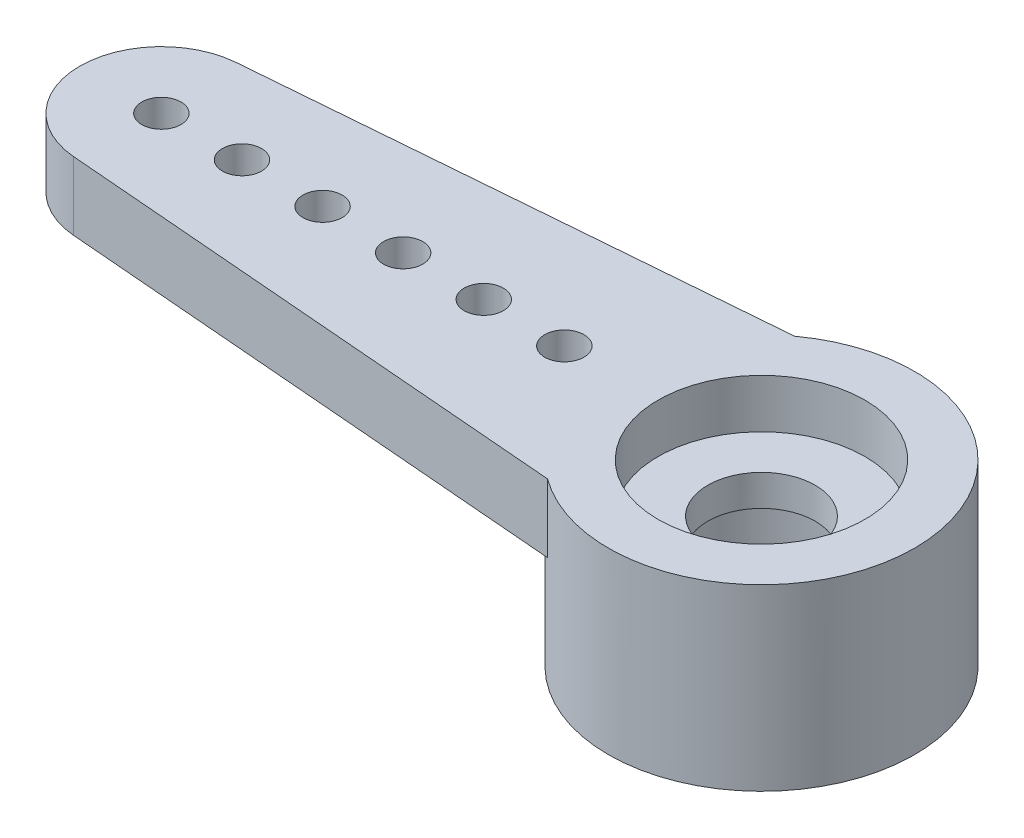
ISO-10303-21;
HEADER;
FILE_DESCRIPTION(('STEP AP214'),'2;1');
FILE_NAME('part.step','',(''),(''),'','','');
FILE_SCHEMA(('AUTOMOTIVE_DESIGN { 1 0 10303 214 1 1 1 1 }'));
ENDSEC;
DATA;
#1=APPLICATION_CONTEXT('core data for automotive mechanical design processes');
#2=APPLICATION_PROTOCOL_DEFINITION('international standard','automotive_design',2000,#1);
#3=PRODUCT_CONTEXT('',#1,'mechanical');
#4=PRODUCT('Part','Part','',(#3));
#5=PRODUCT_RELATED_PRODUCT_CATEGORY('part','',(#4));
#6=PRODUCT_DEFINITION_FORMATION('','',#4);
#7=PRODUCT_DEFINITION_CONTEXT('part definition',#1,'design');
#8=PRODUCT_DEFINITION('design','',#6,#7);
#9=PRODUCT_DEFINITION_SHAPE('','',#8);
#10=(LENGTH_UNIT() NAMED_UNIT(*) SI_UNIT(.MILLI.,.METRE.));
#11=(NAMED_UNIT(*) PLANE_ANGLE_UNIT() SI_UNIT($,.RADIAN.));
#12=(NAMED_UNIT(*) SI_UNIT($,.STERADIAN.) SOLID_ANGLE_UNIT());
#13=UNCERTAINTY_MEASURE_WITH_UNIT(LENGTH_MEASURE(1.E-05),#10,'distance_accuracy_value','');
#14=(GEOMETRIC_REPRESENTATION_CONTEXT(3) GLOBAL_UNCERTAINTY_ASSIGNED_CONTEXT((#13)) GLOBAL_UNIT_ASSIGNED_CONTEXT((#10,
#11,#12)) REPRESENTATION_CONTEXT('',''));
#15=CARTESIAN_POINT('',(0.,0.,0.));
#16=DIRECTION('',(0.,0.,1.));
#17=DIRECTION('',(1.,0.,0.));
#18=AXIS2_PLACEMENT_3D('',#15,#16,#17);
#19=CARTESIAN_POINT('',(0.,-2.6162,0.));
#20=DIRECTION('',(0.,1.,0.));
#21=DIRECTION('',(0.,0.,1.));
#22=AXIS2_PLACEMENT_3D('',#19,#20,#21);
#23=CYLINDRICAL_SURFACE('',#22,1.27);
#24=CARTESIAN_POINT('',(0.,0.4572,0.));
#25=DIRECTION('',(0.,1.,0.));
#26=DIRECTION('',(0.,0.,1.));
#27=AXIS2_PLACEMENT_3D('',#24,#25,#26);
#28=CIRCLE('',#27,1.27);
#29=CARTESIAN_POINT('',(0.,0.4572,1.27));
#30=VERTEX_POINT('',#29);
#31=EDGE_CURVE('E131',#30,#30,#28,.F.);
#32=ORIENTED_EDGE('',*,*,#31,.F.);
#33=EDGE_LOOP('',(#32));
#34=FACE_BOUND('',#33,.T.);
#35=CARTESIAN_POINT('',(0.,-0.2794,0.));
#36=DIRECTION('',(0.,-1.,0.));
#37=DIRECTION('',(0.,0.,-1.));
#38=AXIS2_PLACEMENT_3D('',#35,#36,#37);
#39=CIRCLE('',#38,1.27);
#40=CARTESIAN_POINT('',(0.,-0.2794,-1.27));
#41=VERTEX_POINT('',#40);
#42=EDGE_CURVE('E38',#41,#41,#39,.F.);
#43=ORIENTED_EDGE('',*,*,#42,.F.);
#44=EDGE_LOOP('',(#43));
#45=FACE_BOUND('',#44,.T.);
#46=ADVANCED_FACE('F34',(#34,#45),#23,.F.);
#47=CARTESIAN_POINT('',(0.,1.6129,0.));
#48=DIRECTION('',(0.,-1.,0.));
#49=DIRECTION('',(0.,0.,-1.));
#50=AXIS2_PLACEMENT_3D('',#47,#48,#49);
#51=CYLINDRICAL_SURFACE('',#50,3.6195);
#52=DIRECTION('',(0.,-1.,0.));
#53=VECTOR('',#52,1.);
#54=CARTESIAN_POINT('',(-2.13741415032277,1.6129,2.921));
#55=LINE('',#54,#53);
#56=CARTESIAN_POINT('',(-2.13741415032277,1.6129,2.921));
#57=VERTEX_POINT('',#56);
#58=CARTESIAN_POINT('',(-2.13741415032277,0.,2.921));
#59=VERTEX_POINT('',#58);
#60=EDGE_CURVE('E92',#57,#59,#55,.T.);
#61=ORIENTED_EDGE('',*,*,#60,.T.);
#62=CARTESIAN_POINT('',(0.,0.,0.));
#63=DIRECTION('',(0.,1.,0.));
#64=DIRECTION('',(0.,0.,1.));
#65=AXIS2_PLACEMENT_3D('',#62,#63,#64);
#66=CIRCLE('',#65,3.6195);
#67=CARTESIAN_POINT('',(-2.13741415032277,0.,-2.921));
#68=VERTEX_POINT('',#67);
#69=EDGE_CURVE('E11',#68,#59,#66,.T.);
#70=ORIENTED_EDGE('',*,*,#69,.F.);
#71=DIRECTION('',(0.,-1.,0.));
#72=VECTOR('',#71,1.);
#73=CARTESIAN_POINT('',(-2.13741415032277,1.6129,-2.921));
#74=LINE('',#73,#72);
#75=CARTESIAN_POINT('',(-2.13741415032277,1.6129,-2.921));
#76=VERTEX_POINT('',#75);
#77=EDGE_CURVE('E44',#76,#68,#74,.T.);
#78=ORIENTED_EDGE('',*,*,#77,.F.);
#79=CARTESIAN_POINT('',(0.,1.6129,0.));
#80=DIRECTION('',(0.,1.,0.));
#81=DIRECTION('',(0.,0.,1.));
#82=AXIS2_PLACEMENT_3D('',#79,#80,#81);
#83=CIRCLE('',#82,3.6195);
#84=EDGE_CURVE('E95',#57,#76,#83,.T.);
#85=ORIENTED_EDGE('',*,*,#84,.F.);
#86=EDGE_LOOP('',(#61,#70,#78,#85));
#87=FACE_BOUND('',#86,.T.);
#88=CARTESIAN_POINT('',(0.,-2.6162,0.));
#89=DIRECTION('',(0.,1.,0.));
#90=DIRECTION('',(0.,0.,1.));
#91=AXIS2_PLACEMENT_3D('',#88,#89,#90);
#92=CIRCLE('',#91,3.6195);
#93=CARTESIAN_POINT('',(0.,-2.6162,3.6195));
#94=VERTEX_POINT('',#93);
#95=EDGE_CURVE('E110',#94,#94,#92,.T.);
#96=ORIENTED_EDGE('',*,*,#95,.T.);
#97=EDGE_LOOP('',(#96));
#98=FACE_BOUND('',#97,.T.);
#99=ADVANCED_FACE('F36',(#87,#98),#51,.T.);
#100=CARTESIAN_POINT('',(-14.3430596900559,1.6129,-1.92399194172469));
#101=DIRECTION('',(0.0814130180562945,0.,0.996680450541178));
#102=DIRECTION('',(0.996680450541178,0.,-0.0814130180562945));
#103=AXIS2_PLACEMENT_3D('',#100,#101,#102);
#104=PLANE('',#103);
#105=DIRECTION('',(-0.996680450541178,0.,0.0814130180562945));
#106=VECTOR('',#105,1.);
#107=CARTESIAN_POINT('',(-14.3430596900559,0.,-1.92399194172469));
#108=LINE('',#107,#106);
#109=CARTESIAN_POINT('',(-14.3430596900559,0.,-1.92399194172469));
#110=VERTEX_POINT('',#109);
#111=EDGE_CURVE('E68',#68,#110,#108,.T.);
#112=ORIENTED_EDGE('',*,*,#111,.T.);
#113=DIRECTION('',(0.,-1.,0.));
#114=VECTOR('',#113,1.);
#115=CARTESIAN_POINT('',(-14.3430596900559,1.6129,-1.92399194172469));
#116=LINE('',#115,#114);
#117=CARTESIAN_POINT('',(-14.3430596900559,1.6129,-1.92399194172469));
#118=VERTEX_POINT('',#117);
#119=EDGE_CURVE('E99',#118,#110,#116,.T.);
#120=ORIENTED_EDGE('',*,*,#119,.F.);
#121=DIRECTION('',(-0.996680450541178,0.,0.0814130180562945));
#122=VECTOR('',#121,1.);
#123=CARTESIAN_POINT('',(-14.3430596900559,1.6129,-1.92399194172469));
#124=LINE('',#123,#122);
#125=EDGE_CURVE('E80',#76,#118,#124,.T.);
#126=ORIENTED_EDGE('',*,*,#125,.F.);
#127=ORIENTED_EDGE('',*,*,#77,.T.);
#128=EDGE_LOOP('',(#112,#120,#126,#127));
#129=FACE_BOUND('',#128,.T.);
#130=ADVANCED_FACE('F168',(#129),#104,.F.);
#131=CARTESIAN_POINT('',(-14.1859,1.6129,0.));
#132=DIRECTION('',(0.,-1.,0.));
#133=DIRECTION('',(0.,0.,-1.));
#134=AXIS2_PLACEMENT_3D('',#131,#132,#133);
#135=CYLINDRICAL_SURFACE('',#134,1.9304);
#136=CARTESIAN_POINT('',(-14.1859,0.,0.));
#137=DIRECTION('',(0.,1.,0.));
#138=DIRECTION('',(0.,0.,1.));
#139=AXIS2_PLACEMENT_3D('',#136,#137,#138);
#140=CIRCLE('',#139,1.9304);
#141=CARTESIAN_POINT('',(-14.3430596900559,0.,1.92399194172469));
#142=VERTEX_POINT('',#141);
#143=EDGE_CURVE('E75',#110,#142,#140,.T.);
#144=ORIENTED_EDGE('',*,*,#143,.T.);
#145=DIRECTION('',(0.,-1.,0.));
#146=VECTOR('',#145,1.);
#147=CARTESIAN_POINT('',(-14.3430596900559,1.6129,1.92399194172469));
#148=LINE('',#147,#146);
#149=CARTESIAN_POINT('',(-14.3430596900559,1.6129,1.92399194172469));
#150=VERTEX_POINT('',#149);
#151=EDGE_CURVE('E94',#150,#142,#148,.T.);
#152=ORIENTED_EDGE('',*,*,#151,.F.);
#153=CARTESIAN_POINT('',(-14.1859,1.6129,0.));
#154=DIRECTION('',(0.,1.,0.));
#155=DIRECTION('',(0.,0.,1.));
#156=AXIS2_PLACEMENT_3D('',#153,#154,#155);
#157=CIRCLE('',#156,1.9304);
#158=EDGE_CURVE('E101',#118,#150,#157,.T.);
#159=ORIENTED_EDGE('',*,*,#158,.F.);
#160=ORIENTED_EDGE('',*,*,#119,.T.);
#161=EDGE_LOOP('',(#144,#152,#159,#160));
#162=FACE_BOUND('',#161,.T.);
#163=ADVANCED_FACE('F166',(#162),#135,.T.);
#164=CARTESIAN_POINT('',(-14.3430596900559,1.6129,1.92399194172469));
#165=DIRECTION('',(0.0814130180562943,0.,-0.996680450541178));
#166=DIRECTION('',(-0.996680450541178,0.,-0.0814130180562943));
#167=AXIS2_PLACEMENT_3D('',#164,#165,#166);
#168=PLANE('',#167);
#169=DIRECTION('',(0.996680450541178,0.,0.0814130180562943));
#170=VECTOR('',#169,1.);
#171=CARTESIAN_POINT('',(-14.3430596900559,0.,1.92399194172469));
#172=LINE('',#171,#170);
#173=EDGE_CURVE('E86',#142,#59,#172,.T.);
#174=ORIENTED_EDGE('',*,*,#173,.T.);
#175=ORIENTED_EDGE('',*,*,#60,.F.);
#176=DIRECTION('',(0.996680450541178,0.,0.0814130180562943));
#177=VECTOR('',#176,1.);
#178=CARTESIAN_POINT('',(-14.3430596900559,1.6129,1.92399194172469));
#179=LINE('',#178,#177);
#180=EDGE_CURVE('E53',#150,#57,#179,.T.);
#181=ORIENTED_EDGE('',*,*,#180,.F.);
#182=ORIENTED_EDGE('',*,*,#151,.T.);
#183=EDGE_LOOP('',(#174,#175,#181,#182));
#184=FACE_BOUND('',#183,.T.);
#185=ADVANCED_FACE('F91',(#184),#168,.F.);
#186=CARTESIAN_POINT('',(0.,1.6129,0.));
#187=DIRECTION('',(0.,1.,0.));
#188=DIRECTION('',(0.,0.,1.));
#189=AXIS2_PLACEMENT_3D('',#186,#187,#188);
#190=PLANE('',#189);
#191=CARTESIAN_POINT('',(0.,1.6129,0.));
#192=DIRECTION('',(0.,1.,0.));
#193=DIRECTION('',(0.,0.,1.));
#194=AXIS2_PLACEMENT_3D('',#191,#192,#193);
#195=CIRCLE('',#194,2.44475);
#196=CARTESIAN_POINT('',(0.,1.6129,2.44475));
#197=VERTEX_POINT('',#196);
#198=EDGE_CURVE('E139',#197,#197,#195,.T.);
#199=ORIENTED_EDGE('',*,*,#198,.F.);
#200=EDGE_LOOP('',(#199));
#201=FACE_BOUND('',#200,.T.);
#202=CARTESIAN_POINT('',(-12.2809,1.6129,0.));
#203=DIRECTION('',(0.,1.,0.));
#204=DIRECTION('',(0.,0.,1.));
#205=AXIS2_PLACEMENT_3D('',#202,#203,#204);
#206=CIRCLE('',#205,0.46355);
#207=CARTESIAN_POINT('',(-12.2809,1.6129,0.46355));
#208=VERTEX_POINT('',#207);
#209=EDGE_CURVE('E130',#208,#208,#206,.T.);
#210=ORIENTED_EDGE('',*,*,#209,.F.);
#211=EDGE_LOOP('',(#210));
#212=FACE_BOUND('',#211,.T.);
#213=CARTESIAN_POINT('',(-10.3759,1.6129,0.));
#214=DIRECTION('',(0.,1.,0.));
#215=DIRECTION('',(0.,0.,1.));
#216=AXIS2_PLACEMENT_3D('',#213,#214,#215);
#217=CIRCLE('',#216,0.46355);
#218=CARTESIAN_POINT('',(-10.3759,1.6129,0.46355));
#219=VERTEX_POINT('',#218);
#220=EDGE_CURVE('E127',#219,#219,#217,.T.);
#221=ORIENTED_EDGE('',*,*,#220,.F.);
#222=EDGE_LOOP('',(#221));
#223=FACE_BOUND('',#222,.T.);
#224=CARTESIAN_POINT('',(-8.4709,1.6129,0.));
#225=DIRECTION('',(0.,1.,0.));
#226=DIRECTION('',(0.,0.,1.));
#227=AXIS2_PLACEMENT_3D('',#224,#225,#226);
#228=CIRCLE('',#227,0.46355);
#229=CARTESIAN_POINT('',(-8.4709,1.6129,0.46355));
#230=VERTEX_POINT('',#229);
#231=EDGE_CURVE('E123',#230,#230,#228,.T.);
#232=ORIENTED_EDGE('',*,*,#231,.F.);
#233=EDGE_LOOP('',(#232));
#234=FACE_BOUND('',#233,.T.);
#235=CARTESIAN_POINT('',(-6.5659,1.6129,0.));
#236=DIRECTION('',(0.,1.,0.));
#237=DIRECTION('',(0.,0.,1.));
#238=AXIS2_PLACEMENT_3D('',#235,#236,#237);
#239=CIRCLE('',#238,0.46355);
#240=CARTESIAN_POINT('',(-6.5659,1.6129,0.46355));
#241=VERTEX_POINT('',#240);
#242=EDGE_CURVE('E119',#241,#241,#239,.T.);
#243=ORIENTED_EDGE('',*,*,#242,.F.);
#244=EDGE_LOOP('',(#243));
#245=FACE_BOUND('',#244,.T.);
#246=CARTESIAN_POINT('',(-4.6609,1.6129,0.));
#247=DIRECTION('',(0.,1.,0.));
#248=DIRECTION('',(0.,0.,1.));
#249=AXIS2_PLACEMENT_3D('',#246,#247,#248);
#250=CIRCLE('',#249,0.46355);
#251=CARTESIAN_POINT('',(-4.6609,1.6129,0.46355));
#252=VERTEX_POINT('',#251);
#253=EDGE_CURVE('E115',#252,#252,#250,.T.);
#254=ORIENTED_EDGE('',*,*,#253,.F.);
#255=EDGE_LOOP('',(#254));
#256=FACE_BOUND('',#255,.T.);
#257=CARTESIAN_POINT('',(-14.1859,1.6129,0.));
#258=DIRECTION('',(0.,1.,0.));
#259=DIRECTION('',(0.,0.,1.));
#260=AXIS2_PLACEMENT_3D('',#257,#258,#259);
#261=CIRCLE('',#260,0.46355);
#262=CARTESIAN_POINT('',(-14.1859,1.6129,0.463550000000002));
#263=VERTEX_POINT('',#262);
#264=EDGE_CURVE('E111',#263,#263,#261,.T.);
#265=ORIENTED_EDGE('',*,*,#264,.F.);
#266=EDGE_LOOP('',(#265));
#267=FACE_BOUND('',#266,.T.);
#268=ORIENTED_EDGE('',*,*,#180,.T.);
#269=ORIENTED_EDGE('',*,*,#84,.T.);
#270=ORIENTED_EDGE('',*,*,#125,.T.);
#271=ORIENTED_EDGE('',*,*,#158,.T.);
#272=EDGE_LOOP('',(#268,#269,#270,#271));
#273=FACE_BOUND('',#272,.T.);
#274=ADVANCED_FACE('F165',(#201,#212,#223,#234,#245,#256,#267,#273),#190,.T.);
#275=CARTESIAN_POINT('',(0.,0.,0.));
#276=DIRECTION('',(0.,1.,0.));
#277=DIRECTION('',(0.,0.,1.));
#278=AXIS2_PLACEMENT_3D('',#275,#276,#277);
#279=PLANE('',#278);
#280=CARTESIAN_POINT('',(-12.2809,0.,0.));
#281=DIRECTION('',(0.,1.,0.));
#282=DIRECTION('',(0.,0.,1.));
#283=AXIS2_PLACEMENT_3D('',#280,#281,#282);
#284=CIRCLE('',#283,0.46355);
#285=CARTESIAN_POINT('',(-12.2809,0.,0.46355));
#286=VERTEX_POINT('',#285);
#287=EDGE_CURVE('E128',#286,#286,#284,.T.);
#288=ORIENTED_EDGE('',*,*,#287,.T.);
#289=EDGE_LOOP('',(#288));
#290=FACE_BOUND('',#289,.T.);
#291=CARTESIAN_POINT('',(-10.3759,0.,0.));
#292=DIRECTION('',(0.,1.,0.));
#293=DIRECTION('',(0.,0.,1.));
#294=AXIS2_PLACEMENT_3D('',#291,#292,#293);
#295=CIRCLE('',#294,0.46355);
#296=CARTESIAN_POINT('',(-10.3759,0.,0.46355));
#297=VERTEX_POINT('',#296);
#298=EDGE_CURVE('E124',#297,#297,#295,.T.);
#299=ORIENTED_EDGE('',*,*,#298,.T.);
#300=EDGE_LOOP('',(#299));
#301=FACE_BOUND('',#300,.T.);
#302=CARTESIAN_POINT('',(-8.4709,0.,0.));
#303=DIRECTION('',(0.,1.,0.));
#304=DIRECTION('',(0.,0.,1.));
#305=AXIS2_PLACEMENT_3D('',#302,#303,#304);
#306=CIRCLE('',#305,0.46355);
#307=CARTESIAN_POINT('',(-8.4709,0.,0.46355));
#308=VERTEX_POINT('',#307);
#309=EDGE_CURVE('E120',#308,#308,#306,.T.);
#310=ORIENTED_EDGE('',*,*,#309,.T.);
#311=EDGE_LOOP('',(#310));
#312=FACE_BOUND('',#311,.T.);
#313=CARTESIAN_POINT('',(-6.5659,0.,0.));
#314=DIRECTION('',(0.,1.,0.));
#315=DIRECTION('',(0.,0.,1.));
#316=AXIS2_PLACEMENT_3D('',#313,#314,#315);
#317=CIRCLE('',#316,0.46355);
#318=CARTESIAN_POINT('',(-6.5659,0.,0.46355));
#319=VERTEX_POINT('',#318);
#320=EDGE_CURVE('E116',#319,#319,#317,.T.);
#321=ORIENTED_EDGE('',*,*,#320,.T.);
#322=EDGE_LOOP('',(#321));
#323=FACE_BOUND('',#322,.T.);
#324=CARTESIAN_POINT('',(-4.6609,0.,0.));
#325=DIRECTION('',(0.,1.,0.));
#326=DIRECTION('',(0.,0.,1.));
#327=AXIS2_PLACEMENT_3D('',#324,#325,#326);
#328=CIRCLE('',#327,0.46355);
#329=CARTESIAN_POINT('',(-4.6609,0.,0.46355));
#330=VERTEX_POINT('',#329);
#331=EDGE_CURVE('E112',#330,#330,#328,.T.);
#332=ORIENTED_EDGE('',*,*,#331,.T.);
#333=EDGE_LOOP('',(#332));
#334=FACE_BOUND('',#333,.T.);
#335=CARTESIAN_POINT('',(-14.1859,0.,0.));
#336=DIRECTION('',(0.,1.,0.));
#337=DIRECTION('',(0.,0.,1.));
#338=AXIS2_PLACEMENT_3D('',#335,#336,#337);
#339=CIRCLE('',#338,0.46355);
#340=CARTESIAN_POINT('',(-14.1859,0.,0.463550000000002));
#341=VERTEX_POINT('',#340);
#342=EDGE_CURVE('E107',#341,#341,#339,.T.);
#343=ORIENTED_EDGE('',*,*,#342,.T.);
#344=EDGE_LOOP('',(#343));
#345=FACE_BOUND('',#344,.T.);
#346=ORIENTED_EDGE('',*,*,#111,.F.);
#347=ORIENTED_EDGE('',*,*,#69,.T.);
#348=ORIENTED_EDGE('',*,*,#173,.F.);
#349=ORIENTED_EDGE('',*,*,#143,.F.);
#350=EDGE_LOOP('',(#346,#347,#348,#349));
#351=FACE_BOUND('',#350,.T.);
#352=ADVANCED_FACE('F85',(#290,#301,#312,#323,#334,#345,#351),#279,.F.);
#353=CARTESIAN_POINT('',(0.,-2.6162,0.));
#354=DIRECTION('',(0.,1.,0.));
#355=DIRECTION('',(0.,0.,1.));
#356=AXIS2_PLACEMENT_3D('',#353,#354,#355);
#357=PLANE('',#356);
#358=CARTESIAN_POINT('',(0.,-2.6162,0.));
#359=DIRECTION('',(0.,-1.,0.));
#360=DIRECTION('',(0.,0.,-1.));
#361=AXIS2_PLACEMENT_3D('',#358,#359,#360);
#362=CIRCLE('',#361,2.286);
#363=CARTESIAN_POINT('',(0.,-2.6162,-2.286));
#364=VERTEX_POINT('',#363);
#365=EDGE_CURVE('E146',#364,#364,#362,.T.);
#366=ORIENTED_EDGE('',*,*,#365,.F.);
#367=EDGE_LOOP('',(#366));
#368=FACE_BOUND('',#367,.T.);
#369=ORIENTED_EDGE('',*,*,#95,.F.);
#370=EDGE_LOOP('',(#369));
#371=FACE_BOUND('',#370,.T.);
#372=ADVANCED_FACE('F189',(#368,#371),#357,.F.);
#373=CARTESIAN_POINT('',(-14.1859,-2.6162,0.));
#374=DIRECTION('',(0.,1.,0.));
#375=DIRECTION('',(0.,0.,1.));
#376=AXIS2_PLACEMENT_3D('',#373,#374,#375);
#377=CYLINDRICAL_SURFACE('',#376,0.46355);
#378=ORIENTED_EDGE('',*,*,#264,.T.);
#379=EDGE_LOOP('',(#378));
#380=FACE_BOUND('',#379,.T.);
#381=ORIENTED_EDGE('',*,*,#342,.F.);
#382=EDGE_LOOP('',(#381));
#383=FACE_BOUND('',#382,.T.);
#384=ADVANCED_FACE('F186',(#380,#383),#377,.F.);
#385=CARTESIAN_POINT('',(-4.6609,-2.6162,0.));
#386=DIRECTION('',(0.,1.,0.));
#387=DIRECTION('',(0.,0.,1.));
#388=AXIS2_PLACEMENT_3D('',#385,#386,#387);
#389=CYLINDRICAL_SURFACE('',#388,0.46355);
#390=ORIENTED_EDGE('',*,*,#253,.T.);
#391=EDGE_LOOP('',(#390));
#392=FACE_BOUND('',#391,.T.);
#393=ORIENTED_EDGE('',*,*,#331,.F.);
#394=EDGE_LOOP('',(#393));
#395=FACE_BOUND('',#394,.T.);
#396=ADVANCED_FACE('F184',(#392,#395),#389,.F.);
#397=CARTESIAN_POINT('',(-6.5659,-2.6162,0.));
#398=DIRECTION('',(0.,1.,0.));
#399=DIRECTION('',(0.,0.,1.));
#400=AXIS2_PLACEMENT_3D('',#397,#398,#399);
#401=CYLINDRICAL_SURFACE('',#400,0.46355);
#402=ORIENTED_EDGE('',*,*,#242,.T.);
#403=EDGE_LOOP('',(#402));
#404=FACE_BOUND('',#403,.T.);
#405=ORIENTED_EDGE('',*,*,#320,.F.);
#406=EDGE_LOOP('',(#405));
#407=FACE_BOUND('',#406,.T.);
#408=ADVANCED_FACE('F215',(#404,#407),#401,.F.);
#409=CARTESIAN_POINT('',(-8.4709,-2.6162,0.));
#410=DIRECTION('',(0.,1.,0.));
#411=DIRECTION('',(0.,0.,1.));
#412=AXIS2_PLACEMENT_3D('',#409,#410,#411);
#413=CYLINDRICAL_SURFACE('',#412,0.46355);
#414=ORIENTED_EDGE('',*,*,#231,.T.);
#415=EDGE_LOOP('',(#414));
#416=FACE_BOUND('',#415,.T.);
#417=ORIENTED_EDGE('',*,*,#309,.F.);
#418=EDGE_LOOP('',(#417));
#419=FACE_BOUND('',#418,.T.);
#420=ADVANCED_FACE('F220',(#416,#419),#413,.F.);
#421=CARTESIAN_POINT('',(-10.3759,-2.6162,0.));
#422=DIRECTION('',(0.,1.,0.));
#423=DIRECTION('',(0.,0.,1.));
#424=AXIS2_PLACEMENT_3D('',#421,#422,#423);
#425=CYLINDRICAL_SURFACE('',#424,0.46355);
#426=ORIENTED_EDGE('',*,*,#220,.T.);
#427=EDGE_LOOP('',(#426));
#428=FACE_BOUND('',#427,.T.);
#429=ORIENTED_EDGE('',*,*,#298,.F.);
#430=EDGE_LOOP('',(#429));
#431=FACE_BOUND('',#430,.T.);
#432=ADVANCED_FACE('F229',(#428,#431),#425,.F.);
#433=CARTESIAN_POINT('',(-12.2809,-2.6162,0.));
#434=DIRECTION('',(0.,1.,0.));
#435=DIRECTION('',(0.,0.,1.));
#436=AXIS2_PLACEMENT_3D('',#433,#434,#435);
#437=CYLINDRICAL_SURFACE('',#436,0.46355);
#438=ORIENTED_EDGE('',*,*,#209,.T.);
#439=EDGE_LOOP('',(#438));
#440=FACE_BOUND('',#439,.T.);
#441=ORIENTED_EDGE('',*,*,#287,.F.);
#442=EDGE_LOOP('',(#441));
#443=FACE_BOUND('',#442,.T.);
#444=ADVANCED_FACE('F236',(#440,#443),#437,.F.);
#445=CARTESIAN_POINT('',(0.,0.4572,0.));
#446=DIRECTION('',(0.,1.,0.));
#447=DIRECTION('',(0.,0.,1.));
#448=AXIS2_PLACEMENT_3D('',#445,#446,#447);
#449=PLANE('',#448);
#450=CARTESIAN_POINT('',(0.,0.4572,0.));
#451=DIRECTION('',(0.,1.,0.));
#452=DIRECTION('',(0.,0.,1.));
#453=AXIS2_PLACEMENT_3D('',#450,#451,#452);
#454=CIRCLE('',#453,2.44475);
#455=CARTESIAN_POINT('',(0.,0.4572,2.44475));
#456=VERTEX_POINT('',#455);
#457=EDGE_CURVE('E133',#456,#456,#454,.T.);
#458=ORIENTED_EDGE('',*,*,#457,.T.);
#459=EDGE_LOOP('',(#458));
#460=FACE_BOUND('',#459,.T.);
#461=ORIENTED_EDGE('',*,*,#31,.T.);
#462=EDGE_LOOP('',(#461));
#463=FACE_BOUND('',#462,.T.);
#464=ADVANCED_FACE('F240',(#460,#463),#449,.T.);
#465=CARTESIAN_POINT('',(0.,0.4572,0.));
#466=DIRECTION('',(0.,1.,0.));
#467=DIRECTION('',(0.,0.,1.));
#468=AXIS2_PLACEMENT_3D('',#465,#466,#467);
#469=CYLINDRICAL_SURFACE('',#468,2.44475);
#470=ORIENTED_EDGE('',*,*,#457,.F.);
#471=EDGE_LOOP('',(#470));
#472=FACE_BOUND('',#471,.T.);
#473=ORIENTED_EDGE('',*,*,#198,.T.);
#474=EDGE_LOOP('',(#473));
#475=FACE_BOUND('',#474,.T.);
#476=ADVANCED_FACE('F242',(#472,#475),#469,.F.);
#477=CARTESIAN_POINT('',(0.,-0.2794,0.));
#478=DIRECTION('',(0.,-1.,0.));
#479=DIRECTION('',(0.,0.,-1.));
#480=AXIS2_PLACEMENT_3D('',#477,#478,#479);
#481=PLANE('',#480);
#482=CARTESIAN_POINT('',(0.,-0.2794,0.));
#483=DIRECTION('',(0.,-1.,0.));
#484=DIRECTION('',(0.,0.,-1.));
#485=AXIS2_PLACEMENT_3D('',#482,#483,#484);
#486=CIRCLE('',#485,2.286);
#487=CARTESIAN_POINT('',(0.,-0.2794,-2.286));
#488=VERTEX_POINT('',#487);
#489=EDGE_CURVE('E260',#488,#488,#486,.T.);
#490=ORIENTED_EDGE('',*,*,#489,.T.);
#491=EDGE_LOOP('',(#490));
#492=FACE_BOUND('',#491,.T.);
#493=ORIENTED_EDGE('',*,*,#42,.T.);
#494=EDGE_LOOP('',(#493));
#495=FACE_BOUND('',#494,.T.);
#496=ADVANCED_FACE('F245',(#492,#495),#481,.T.);
#497=CARTESIAN_POINT('',(0.,-0.2794,0.));
#498=DIRECTION('',(0.,-1.,0.));
#499=DIRECTION('',(0.,0.,-1.));
#500=AXIS2_PLACEMENT_3D('',#497,#498,#499);
#501=CYLINDRICAL_SURFACE('',#500,2.286);
#502=ORIENTED_EDGE('',*,*,#489,.F.);
#503=EDGE_LOOP('',(#502));
#504=FACE_BOUND('',#503,.T.);
#505=ORIENTED_EDGE('',*,*,#365,.T.);
#506=EDGE_LOOP('',(#505));
#507=FACE_BOUND('',#506,.T.);
#508=ADVANCED_FACE('F249',(#504,#507),#501,.F.);
#509=CLOSED_SHELL('',(#46,#99,#130,#163,#185,#274,#352,#372,#384,#396,#408,#420,#432,#444,#464,
#476,#496,#508));
#510=MANIFOLD_SOLID_BREP('B2',#509);
#511=ADVANCED_BREP_SHAPE_REPRESENTATION('',(#18,#510),#14);
#512=SHAPE_DEFINITION_REPRESENTATION(#9,#511);
ENDSEC;
END-ISO-10303-21;
